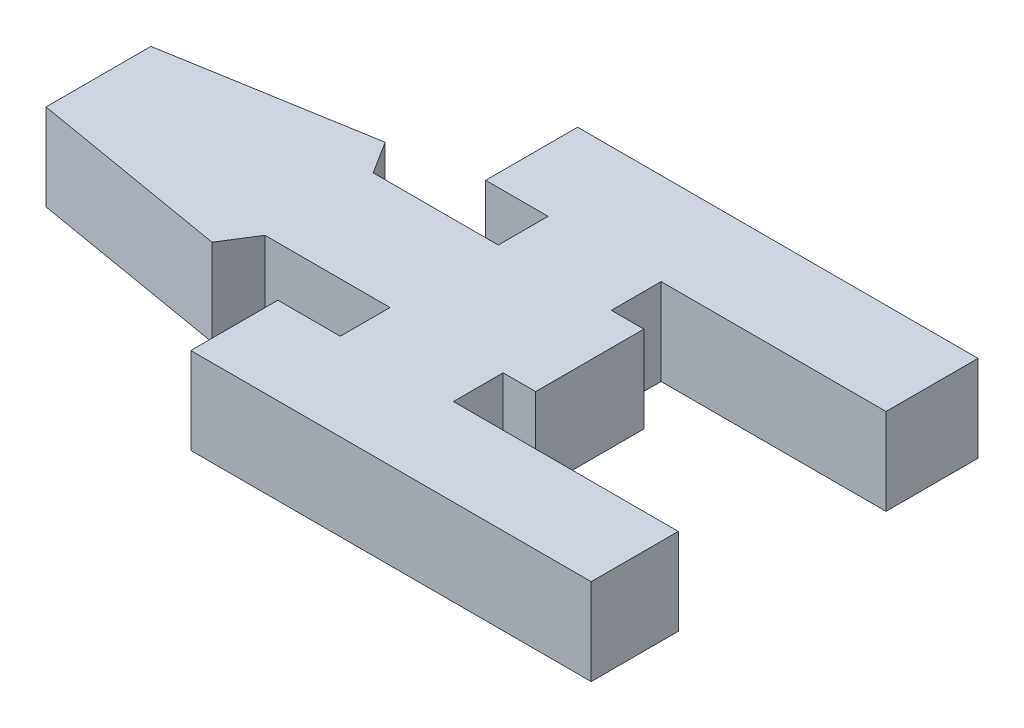
ISO-10303-21;
HEADER;
FILE_DESCRIPTION(('STEP AP214'),'2;1');
FILE_NAME('part.step','',(''),(''),'','','');
FILE_SCHEMA(('AUTOMOTIVE_DESIGN { 1 0 10303 214 1 1 1 1 }'));
ENDSEC;
DATA;
#1=APPLICATION_CONTEXT('core data for automotive mechanical design processes');
#2=APPLICATION_PROTOCOL_DEFINITION('international standard','automotive_design',2000,#1);
#3=PRODUCT_CONTEXT('',#1,'mechanical');
#4=PRODUCT('Part','Part','',(#3));
#5=PRODUCT_RELATED_PRODUCT_CATEGORY('part','',(#4));
#6=PRODUCT_DEFINITION_FORMATION('','',#4);
#7=PRODUCT_DEFINITION_CONTEXT('part definition',#1,'design');
#8=PRODUCT_DEFINITION('design','',#6,#7);
#9=PRODUCT_DEFINITION_SHAPE('','',#8);
#10=(LENGTH_UNIT() NAMED_UNIT(*) SI_UNIT(.MILLI.,.METRE.));
#11=(NAMED_UNIT(*) PLANE_ANGLE_UNIT() SI_UNIT($,.RADIAN.));
#12=(NAMED_UNIT(*) SI_UNIT($,.STERADIAN.) SOLID_ANGLE_UNIT());
#13=UNCERTAINTY_MEASURE_WITH_UNIT(LENGTH_MEASURE(1.E-05),#10,'distance_accuracy_value','');
#14=(GEOMETRIC_REPRESENTATION_CONTEXT(3) GLOBAL_UNCERTAINTY_ASSIGNED_CONTEXT((#13)) GLOBAL_UNIT_ASSIGNED_CONTEXT((#10,
#11,#12)) REPRESENTATION_CONTEXT('',''));
#15=CARTESIAN_POINT('',(0.,0.,0.));
#16=DIRECTION('',(0.,0.,1.));
#17=DIRECTION('',(1.,0.,0.));
#18=AXIS2_PLACEMENT_3D('',#15,#16,#17);
#19=CARTESIAN_POINT('',(37.6764063249221,8.,-46.6193365685928));
#20=DIRECTION('',(0.,0.,1.));
#21=DIRECTION('',(1.,0.,0.));
#22=AXIS2_PLACEMENT_3D('',#19,#20,#21);
#23=PLANE('',#22);
#24=DIRECTION('',(-1.,0.,0.));
#25=VECTOR('',#24,1.);
#26=CARTESIAN_POINT('',(37.6764063249221,0.,-46.6193365685928));
#27=LINE('',#26,#25);
#28=CARTESIAN_POINT('',(49.238802000088,0.,-46.6193365685928));
#29=VERTEX_POINT('',#28);
#30=CARTESIAN_POINT('',(37.6764063249221,0.,-46.6193365685928));
#31=VERTEX_POINT('',#30);
#32=EDGE_CURVE('E225',#29,#31,#27,.T.);
#33=ORIENTED_EDGE('',*,*,#32,.T.);
#34=DIRECTION('',(0.,-1.,0.));
#35=VECTOR('',#34,1.);
#36=CARTESIAN_POINT('',(37.6764063249221,8.,-46.6193365685928));
#37=LINE('',#36,#35);
#38=CARTESIAN_POINT('',(37.6764063249221,8.,-46.6193365685928));
#39=VERTEX_POINT('',#38);
#40=EDGE_CURVE('E11',#39,#31,#37,.T.);
#41=ORIENTED_EDGE('',*,*,#40,.F.);
#42=DIRECTION('',(-1.,0.,0.));
#43=VECTOR('',#42,1.);
#44=CARTESIAN_POINT('',(37.6764063249221,8.,-46.6193365685928));
#45=LINE('',#44,#43);
#46=CARTESIAN_POINT('',(49.238802000088,8.,-46.6193365685928));
#47=VERTEX_POINT('',#46);
#48=EDGE_CURVE('E272',#47,#39,#45,.T.);
#49=ORIENTED_EDGE('',*,*,#48,.F.);
#50=DIRECTION('',(0.,-1.,0.));
#51=VECTOR('',#50,1.);
#52=CARTESIAN_POINT('',(49.238802000088,8.,-46.6193365685928));
#53=LINE('',#52,#51);
#54=EDGE_CURVE('E221',#47,#29,#53,.T.);
#55=ORIENTED_EDGE('',*,*,#54,.T.);
#56=EDGE_LOOP('',(#33,#41,#49,#55));
#57=FACE_BOUND('',#56,.T.);
#58=ADVANCED_FACE('F33',(#57),#23,.F.);
#59=CARTESIAN_POINT('',(35.7855400379757,8.,-49.6193365685928));
#60=DIRECTION('',(-0.845981326623893,0.,0.533212523299743));
#61=DIRECTION('',(0.533212523299743,0.,0.845981326623893));
#62=AXIS2_PLACEMENT_3D('',#59,#60,#61);
#63=PLANE('',#62);
#64=DIRECTION('',(-0.533212523299743,0.,-0.845981326623893));
#65=VECTOR('',#64,1.);
#66=CARTESIAN_POINT('',(35.7855400379757,0.,-49.6193365685928));
#67=LINE('',#66,#65);
#68=CARTESIAN_POINT('',(35.7855400379757,0.,-49.6193365685928));
#69=VERTEX_POINT('',#68);
#70=EDGE_CURVE('E228',#31,#69,#67,.T.);
#71=ORIENTED_EDGE('',*,*,#70,.T.);
#72=DIRECTION('',(0.,-1.,0.));
#73=VECTOR('',#72,1.);
#74=CARTESIAN_POINT('',(35.7855400379757,8.,-49.6193365685928));
#75=LINE('',#74,#73);
#76=CARTESIAN_POINT('',(35.7855400379757,8.,-49.6193365685928));
#77=VERTEX_POINT('',#76);
#78=EDGE_CURVE('E41',#77,#69,#75,.T.);
#79=ORIENTED_EDGE('',*,*,#78,.F.);
#80=DIRECTION('',(-0.533212523299743,0.,-0.845981326623893));
#81=VECTOR('',#80,1.);
#82=CARTESIAN_POINT('',(35.7855400379757,8.,-49.6193365685928));
#83=LINE('',#82,#81);
#84=EDGE_CURVE('E140',#39,#77,#83,.T.);
#85=ORIENTED_EDGE('',*,*,#84,.F.);
#86=ORIENTED_EDGE('',*,*,#40,.T.);
#87=EDGE_LOOP('',(#71,#79,#85,#86));
#88=FACE_BOUND('',#87,.T.);
#89=ADVANCED_FACE('F410',(#88),#63,.F.);
#90=CARTESIAN_POINT('',(17.2873048400714,8.,-46.4669887016048));
#91=DIRECTION('',(0.167991595603927,0.,0.985788427506859));
#92=DIRECTION('',(0.98578842750686,0.,-0.167991595603927));
#93=AXIS2_PLACEMENT_3D('',#90,#91,#92);
#94=PLANE('',#93);
#95=DIRECTION('',(-0.98578842750686,0.,0.167991595603927));
#96=VECTOR('',#95,1.);
#97=CARTESIAN_POINT('',(17.2873048400714,0.,-46.4669887016048));
#98=LINE('',#97,#96);
#99=CARTESIAN_POINT('',(17.2873048400714,0.,-46.4669887016048));
#100=VERTEX_POINT('',#99);
#101=EDGE_CURVE('E231',#69,#100,#98,.T.);
#102=ORIENTED_EDGE('',*,*,#101,.T.);
#103=DIRECTION('',(0.,-1.,0.));
#104=VECTOR('',#103,1.);
#105=CARTESIAN_POINT('',(17.2873048400714,8.,-46.4669887016048));
#106=LINE('',#105,#104);
#107=CARTESIAN_POINT('',(17.2873048400714,8.,-46.4669887016048));
#108=VERTEX_POINT('',#107);
#109=EDGE_CURVE('E327',#108,#100,#106,.T.);
#110=ORIENTED_EDGE('',*,*,#109,.F.);
#111=DIRECTION('',(-0.98578842750686,0.,0.167991595603927));
#112=VECTOR('',#111,1.);
#113=CARTESIAN_POINT('',(17.2873048400714,8.,-46.4669887016048));
#114=LINE('',#113,#112);
#115=EDGE_CURVE('E335',#77,#108,#114,.T.);
#116=ORIENTED_EDGE('',*,*,#115,.F.);
#117=ORIENTED_EDGE('',*,*,#78,.T.);
#118=EDGE_LOOP('',(#102,#110,#116,#117));
#119=FACE_BOUND('',#118,.T.);
#120=ADVANCED_FACE('F333',(#119),#94,.F.);
#121=CARTESIAN_POINT('',(17.2873048400714,8.,-46.4669887016048));
#122=DIRECTION('',(1.,0.,0.));
#123=DIRECTION('',(0.,0.,-1.));
#124=AXIS2_PLACEMENT_3D('',#121,#122,#123);
#125=PLANE('',#124);
#126=DIRECTION('',(0.,0.,1.));
#127=VECTOR('',#126,1.);
#128=CARTESIAN_POINT('',(17.2873048400714,0.,-46.4669887016048));
#129=LINE('',#128,#127);
#130=CARTESIAN_POINT('',(17.2873048400714,0.,-36.7743365685928));
#131=VERTEX_POINT('',#130);
#132=EDGE_CURVE('E233',#100,#131,#129,.T.);
#133=ORIENTED_EDGE('',*,*,#132,.T.);
#134=DIRECTION('',(0.,-1.,0.));
#135=VECTOR('',#134,1.);
#136=CARTESIAN_POINT('',(17.2873048400714,8.,-36.7743365685928));
#137=LINE('',#136,#135);
#138=CARTESIAN_POINT('',(17.2873048400714,8.,-36.7743365685928));
#139=VERTEX_POINT('',#138);
#140=EDGE_CURVE('E324',#139,#131,#137,.T.);
#141=ORIENTED_EDGE('',*,*,#140,.F.);
#142=DIRECTION('',(0.,0.,1.));
#143=VECTOR('',#142,1.);
#144=CARTESIAN_POINT('',(17.2873048400714,8.,-46.4669887016048));
#145=LINE('',#144,#143);
#146=EDGE_CURVE('E353',#108,#139,#145,.T.);
#147=ORIENTED_EDGE('',*,*,#146,.F.);
#148=ORIENTED_EDGE('',*,*,#109,.T.);
#149=EDGE_LOOP('',(#133,#141,#147,#148));
#150=FACE_BOUND('',#149,.T.);
#151=ADVANCED_FACE('F344',(#150),#125,.F.);
#152=CARTESIAN_POINT('',(35.7855400379758,8.,-33.6193365685928));
#153=DIRECTION('',(0.168128936753978,0.,-0.985765012883891));
#154=DIRECTION('',(-0.985765012883891,0.,-0.168128936753978));
#155=AXIS2_PLACEMENT_3D('',#152,#153,#154);
#156=PLANE('',#155);
#157=DIRECTION('',(0.985765012883891,0.,0.168128936753978));
#158=VECTOR('',#157,1.);
#159=CARTESIAN_POINT('',(35.7855400379758,0.,-33.6193365685928));
#160=LINE('',#159,#158);
#161=CARTESIAN_POINT('',(35.7855400379758,0.,-33.6193365685928));
#162=VERTEX_POINT('',#161);
#163=EDGE_CURVE('E235',#131,#162,#160,.T.);
#164=ORIENTED_EDGE('',*,*,#163,.T.);
#165=DIRECTION('',(0.,-1.,0.));
#166=VECTOR('',#165,1.);
#167=CARTESIAN_POINT('',(35.7855400379758,8.,-33.6193365685928));
#168=LINE('',#167,#166);
#169=CARTESIAN_POINT('',(35.7855400379758,8.,-33.6193365685928));
#170=VERTEX_POINT('',#169);
#171=EDGE_CURVE('E321',#170,#162,#168,.T.);
#172=ORIENTED_EDGE('',*,*,#171,.F.);
#173=DIRECTION('',(0.985765012883891,0.,0.168128936753978));
#174=VECTOR('',#173,1.);
#175=CARTESIAN_POINT('',(35.7855400379758,8.,-33.6193365685928));
#176=LINE('',#175,#174);
#177=EDGE_CURVE('E350',#139,#170,#176,.T.);
#178=ORIENTED_EDGE('',*,*,#177,.F.);
#179=ORIENTED_EDGE('',*,*,#140,.T.);
#180=EDGE_LOOP('',(#164,#172,#178,#179));
#181=FACE_BOUND('',#180,.T.);
#182=ADVANCED_FACE('F348',(#181),#156,.F.);
#183=CARTESIAN_POINT('',(37.6764063249221,8.,-36.6193365685928));
#184=DIRECTION('',(-0.845981326623894,0.,-0.53321252329974));
#185=DIRECTION('',(-0.53321252329974,0.,0.845981326623894));
#186=AXIS2_PLACEMENT_3D('',#183,#184,#185);
#187=PLANE('',#186);
#188=DIRECTION('',(0.53321252329974,0.,-0.845981326623894));
#189=VECTOR('',#188,1.);
#190=CARTESIAN_POINT('',(37.6764063249221,0.,-36.6193365685928));
#191=LINE('',#190,#189);
#192=CARTESIAN_POINT('',(37.6764063249221,0.,-36.6193365685928));
#193=VERTEX_POINT('',#192);
#194=EDGE_CURVE('E237',#162,#193,#191,.T.);
#195=ORIENTED_EDGE('',*,*,#194,.T.);
#196=DIRECTION('',(0.,-1.,0.));
#197=VECTOR('',#196,1.);
#198=CARTESIAN_POINT('',(37.6764063249221,8.,-36.6193365685928));
#199=LINE('',#198,#197);
#200=CARTESIAN_POINT('',(37.6764063249221,8.,-36.6193365685928));
#201=VERTEX_POINT('',#200);
#202=EDGE_CURVE('E318',#201,#193,#199,.T.);
#203=ORIENTED_EDGE('',*,*,#202,.F.);
#204=DIRECTION('',(0.53321252329974,0.,-0.845981326623894));
#205=VECTOR('',#204,1.);
#206=CARTESIAN_POINT('',(37.6764063249221,8.,-36.6193365685928));
#207=LINE('',#206,#205);
#208=EDGE_CURVE('E352',#170,#201,#207,.T.);
#209=ORIENTED_EDGE('',*,*,#208,.F.);
#210=ORIENTED_EDGE('',*,*,#171,.T.);
#211=EDGE_LOOP('',(#195,#203,#209,#210));
#212=FACE_BOUND('',#211,.T.);
#213=ADVANCED_FACE('F423',(#212),#187,.F.);
#214=CARTESIAN_POINT('',(37.6764063249221,8.,-36.6193365685928));
#215=DIRECTION('',(0.,0.,-1.));
#216=DIRECTION('',(-1.,0.,0.));
#217=AXIS2_PLACEMENT_3D('',#214,#215,#216);
#218=PLANE('',#217);
#219=DIRECTION('',(1.,0.,0.));
#220=VECTOR('',#219,1.);
#221=CARTESIAN_POINT('',(37.6764063249221,0.,-36.6193365685928));
#222=LINE('',#221,#220);
#223=CARTESIAN_POINT('',(49.238802000088,0.,-36.6193365685928));
#224=VERTEX_POINT('',#223);
#225=EDGE_CURVE('E239',#193,#224,#222,.T.);
#226=ORIENTED_EDGE('',*,*,#225,.T.);
#227=DIRECTION('',(0.,-1.,0.));
#228=VECTOR('',#227,1.);
#229=CARTESIAN_POINT('',(49.238802000088,8.,-36.6193365685928));
#230=LINE('',#229,#228);
#231=CARTESIAN_POINT('',(49.238802000088,8.,-36.6193365685928));
#232=VERTEX_POINT('',#231);
#233=EDGE_CURVE('E315',#232,#224,#230,.T.);
#234=ORIENTED_EDGE('',*,*,#233,.F.);
#235=DIRECTION('',(1.,0.,0.));
#236=VECTOR('',#235,1.);
#237=CARTESIAN_POINT('',(37.6764063249221,8.,-36.6193365685928));
#238=LINE('',#237,#236);
#239=EDGE_CURVE('E355',#201,#232,#238,.T.);
#240=ORIENTED_EDGE('',*,*,#239,.F.);
#241=ORIENTED_EDGE('',*,*,#202,.T.);
#242=EDGE_LOOP('',(#226,#234,#240,#241));
#243=FACE_BOUND('',#242,.T.);
#244=ADVANCED_FACE('F426',(#243),#218,.F.);
#245=CARTESIAN_POINT('',(49.238802000088,8.,-36.6193365685928));
#246=DIRECTION('',(1.,0.,0.));
#247=DIRECTION('',(0.,0.,-1.));
#248=AXIS2_PLACEMENT_3D('',#245,#246,#247);
#249=PLANE('',#248);
#250=DIRECTION('',(0.,0.,1.));
#251=VECTOR('',#250,1.);
#252=CARTESIAN_POINT('',(49.238802000088,0.,-36.6193365685928));
#253=LINE('',#252,#251);
#254=CARTESIAN_POINT('',(49.238802000088,0.,-32.0193365685928));
#255=VERTEX_POINT('',#254);
#256=EDGE_CURVE('E241',#224,#255,#253,.T.);
#257=ORIENTED_EDGE('',*,*,#256,.T.);
#258=DIRECTION('',(0.,-1.,0.));
#259=VECTOR('',#258,1.);
#260=CARTESIAN_POINT('',(49.238802000088,8.,-32.0193365685928));
#261=LINE('',#260,#259);
#262=CARTESIAN_POINT('',(49.238802000088,8.,-32.0193365685928));
#263=VERTEX_POINT('',#262);
#264=EDGE_CURVE('E312',#263,#255,#261,.T.);
#265=ORIENTED_EDGE('',*,*,#264,.F.);
#266=DIRECTION('',(0.,0.,1.));
#267=VECTOR('',#266,1.);
#268=CARTESIAN_POINT('',(49.238802000088,8.,-36.6193365685928));
#269=LINE('',#268,#267);
#270=EDGE_CURVE('E361',#232,#263,#269,.T.);
#271=ORIENTED_EDGE('',*,*,#270,.F.);
#272=ORIENTED_EDGE('',*,*,#233,.T.);
#273=EDGE_LOOP('',(#257,#265,#271,#272));
#274=FACE_BOUND('',#273,.T.);
#275=ADVANCED_FACE('F430',(#274),#249,.F.);
#276=CARTESIAN_POINT('',(49.238802000088,8.,-32.0193365685928));
#277=DIRECTION('',(0.,0.,1.));
#278=DIRECTION('',(1.,0.,0.));
#279=AXIS2_PLACEMENT_3D('',#276,#277,#278);
#280=PLANE('',#279);
#281=DIRECTION('',(-1.,0.,0.));
#282=VECTOR('',#281,1.);
#283=CARTESIAN_POINT('',(49.238802000088,0.,-32.0193365685928));
#284=LINE('',#283,#282);
#285=CARTESIAN_POINT('',(43.4731183020399,0.,-32.0193365685928));
#286=VERTEX_POINT('',#285);
#287=EDGE_CURVE('E243',#255,#286,#284,.T.);
#288=ORIENTED_EDGE('',*,*,#287,.T.);
#289=DIRECTION('',(0.,-1.,0.));
#290=VECTOR('',#289,1.);
#291=CARTESIAN_POINT('',(43.4731183020399,8.,-32.0193365685928));
#292=LINE('',#291,#290);
#293=CARTESIAN_POINT('',(43.4731183020399,8.,-32.0193365685928));
#294=VERTEX_POINT('',#293);
#295=EDGE_CURVE('E309',#294,#286,#292,.T.);
#296=ORIENTED_EDGE('',*,*,#295,.F.);
#297=DIRECTION('',(-1.,0.,0.));
#298=VECTOR('',#297,1.);
#299=CARTESIAN_POINT('',(49.238802000088,8.,-32.0193365685928));
#300=LINE('',#299,#298);
#301=EDGE_CURVE('E363',#263,#294,#300,.T.);
#302=ORIENTED_EDGE('',*,*,#301,.F.);
#303=ORIENTED_EDGE('',*,*,#264,.T.);
#304=EDGE_LOOP('',(#288,#296,#302,#303));
#305=FACE_BOUND('',#304,.T.);
#306=ADVANCED_FACE('F434',(#305),#280,.F.);
#307=CARTESIAN_POINT('',(43.4731183020399,8.,-32.0193365685928));
#308=DIRECTION('',(1.,0.,0.));
#309=DIRECTION('',(0.,0.,-1.));
#310=AXIS2_PLACEMENT_3D('',#307,#308,#309);
#311=PLANE('',#310);
#312=DIRECTION('',(0.,0.,1.));
#313=VECTOR('',#312,1.);
#314=CARTESIAN_POINT('',(43.4731183020399,0.,-32.0193365685928));
#315=LINE('',#314,#313);
#316=CARTESIAN_POINT('',(43.4731183020399,0.,-23.9714030734007));
#317=VERTEX_POINT('',#316);
#318=EDGE_CURVE('E245',#286,#317,#315,.T.);
#319=ORIENTED_EDGE('',*,*,#318,.T.);
#320=DIRECTION('',(0.,-1.,0.));
#321=VECTOR('',#320,1.);
#322=CARTESIAN_POINT('',(43.4731183020399,8.,-23.9714030734007));
#323=LINE('',#322,#321);
#324=CARTESIAN_POINT('',(43.4731183020399,8.,-23.9714030734007));
#325=VERTEX_POINT('',#324);
#326=EDGE_CURVE('E306',#325,#317,#323,.T.);
#327=ORIENTED_EDGE('',*,*,#326,.F.);
#328=DIRECTION('',(0.,0.,1.));
#329=VECTOR('',#328,1.);
#330=CARTESIAN_POINT('',(43.4731183020399,8.,-32.0193365685928));
#331=LINE('',#330,#329);
#332=EDGE_CURVE('E365',#294,#325,#331,.T.);
#333=ORIENTED_EDGE('',*,*,#332,.F.);
#334=ORIENTED_EDGE('',*,*,#295,.T.);
#335=EDGE_LOOP('',(#319,#327,#333,#334));
#336=FACE_BOUND('',#335,.T.);
#337=ADVANCED_FACE('F438',(#336),#311,.F.);
#338=CARTESIAN_POINT('',(80.4731183020399,8.,-23.9714030734007));
#339=DIRECTION('',(0.,0.,-1.));
#340=DIRECTION('',(-1.,0.,0.));
#341=AXIS2_PLACEMENT_3D('',#338,#339,#340);
#342=PLANE('',#341);
#343=DIRECTION('',(1.,0.,0.));
#344=VECTOR('',#343,1.);
#345=CARTESIAN_POINT('',(80.4731183020399,0.,-23.9714030734007));
#346=LINE('',#345,#344);
#347=CARTESIAN_POINT('',(80.4731183020399,0.,-23.9714030734007));
#348=VERTEX_POINT('',#347);
#349=EDGE_CURVE('E247',#317,#348,#346,.T.);
#350=ORIENTED_EDGE('',*,*,#349,.T.);
#351=DIRECTION('',(0.,-1.,0.));
#352=VECTOR('',#351,1.);
#353=CARTESIAN_POINT('',(80.4731183020399,8.,-23.9714030734007));
#354=LINE('',#353,#352);
#355=CARTESIAN_POINT('',(80.4731183020399,8.,-23.9714030734007));
#356=VERTEX_POINT('',#355);
#357=EDGE_CURVE('E303',#356,#348,#354,.T.);
#358=ORIENTED_EDGE('',*,*,#357,.F.);
#359=DIRECTION('',(1.,0.,0.));
#360=VECTOR('',#359,1.);
#361=CARTESIAN_POINT('',(80.4731183020399,8.,-23.9714030734007));
#362=LINE('',#361,#360);
#363=EDGE_CURVE('E367',#325,#356,#362,.T.);
#364=ORIENTED_EDGE('',*,*,#363,.F.);
#365=ORIENTED_EDGE('',*,*,#326,.T.);
#366=EDGE_LOOP('',(#350,#358,#364,#365));
#367=FACE_BOUND('',#366,.T.);
#368=ADVANCED_FACE('F442',(#367),#342,.F.);
#369=CARTESIAN_POINT('',(80.4731183020399,8.,-32.0193365685928));
#370=DIRECTION('',(-1.,0.,0.));
#371=DIRECTION('',(0.,0.,1.));
#372=AXIS2_PLACEMENT_3D('',#369,#370,#371);
#373=PLANE('',#372);
#374=DIRECTION('',(0.,0.,-1.));
#375=VECTOR('',#374,1.);
#376=CARTESIAN_POINT('',(80.4731183020399,0.,-32.0193365685928));
#377=LINE('',#376,#375);
#378=CARTESIAN_POINT('',(80.4731183020399,0.,-32.0193365685928));
#379=VERTEX_POINT('',#378);
#380=EDGE_CURVE('E249',#348,#379,#377,.T.);
#381=ORIENTED_EDGE('',*,*,#380,.T.);
#382=DIRECTION('',(0.,-1.,0.));
#383=VECTOR('',#382,1.);
#384=CARTESIAN_POINT('',(80.4731183020399,8.,-32.0193365685928));
#385=LINE('',#384,#383);
#386=CARTESIAN_POINT('',(80.4731183020399,8.,-32.0193365685928));
#387=VERTEX_POINT('',#386);
#388=EDGE_CURVE('E300',#387,#379,#385,.T.);
#389=ORIENTED_EDGE('',*,*,#388,.F.);
#390=DIRECTION('',(0.,0.,-1.));
#391=VECTOR('',#390,1.);
#392=CARTESIAN_POINT('',(80.4731183020399,8.,-32.0193365685928));
#393=LINE('',#392,#391);
#394=EDGE_CURVE('E369',#356,#387,#393,.T.);
#395=ORIENTED_EDGE('',*,*,#394,.F.);
#396=ORIENTED_EDGE('',*,*,#357,.T.);
#397=EDGE_LOOP('',(#381,#389,#395,#396));
#398=FACE_BOUND('',#397,.T.);
#399=ADVANCED_FACE('F446',(#398),#373,.F.);
#400=CARTESIAN_POINT('',(80.4731183020399,8.,-32.0193365685928));
#401=DIRECTION('',(0.,0.,1.));
#402=DIRECTION('',(1.,0.,0.));
#403=AXIS2_PLACEMENT_3D('',#400,#401,#402);
#404=PLANE('',#403);
#405=DIRECTION('',(-1.,0.,0.));
#406=VECTOR('',#405,1.);
#407=CARTESIAN_POINT('',(80.4731183020399,0.,-32.0193365685928));
#408=LINE('',#407,#406);
#409=CARTESIAN_POINT('',(59.6891037028002,0.,-32.0193365685928));
#410=VERTEX_POINT('',#409);
#411=EDGE_CURVE('E251',#379,#410,#408,.T.);
#412=ORIENTED_EDGE('',*,*,#411,.T.);
#413=DIRECTION('',(0.,-1.,0.));
#414=VECTOR('',#413,1.);
#415=CARTESIAN_POINT('',(59.6891037028002,8.,-32.0193365685928));
#416=LINE('',#415,#414);
#417=CARTESIAN_POINT('',(59.6891037028002,8.,-32.0193365685928));
#418=VERTEX_POINT('',#417);
#419=EDGE_CURVE('E297',#418,#410,#416,.T.);
#420=ORIENTED_EDGE('',*,*,#419,.F.);
#421=DIRECTION('',(-1.,0.,0.));
#422=VECTOR('',#421,1.);
#423=CARTESIAN_POINT('',(80.4731183020399,8.,-32.0193365685928));
#424=LINE('',#423,#422);
#425=EDGE_CURVE('E371',#387,#418,#424,.T.);
#426=ORIENTED_EDGE('',*,*,#425,.F.);
#427=ORIENTED_EDGE('',*,*,#388,.T.);
#428=EDGE_LOOP('',(#412,#420,#426,#427));
#429=FACE_BOUND('',#428,.T.);
#430=ADVANCED_FACE('F450',(#429),#404,.F.);
#431=CARTESIAN_POINT('',(59.6891037028002,8.,-36.6193365685928));
#432=DIRECTION('',(-1.,0.,0.));
#433=DIRECTION('',(0.,0.,1.));
#434=AXIS2_PLACEMENT_3D('',#431,#432,#433);
#435=PLANE('',#434);
#436=DIRECTION('',(0.,0.,-1.));
#437=VECTOR('',#436,1.);
#438=CARTESIAN_POINT('',(59.6891037028002,0.,-36.6193365685928));
#439=LINE('',#438,#437);
#440=CARTESIAN_POINT('',(59.6891037028002,0.,-36.6193365685928));
#441=VERTEX_POINT('',#440);
#442=EDGE_CURVE('E253',#410,#441,#439,.T.);
#443=ORIENTED_EDGE('',*,*,#442,.T.);
#444=DIRECTION('',(0.,-1.,0.));
#445=VECTOR('',#444,1.);
#446=CARTESIAN_POINT('',(59.6891037028002,8.,-36.6193365685928));
#447=LINE('',#446,#445);
#448=CARTESIAN_POINT('',(59.6891037028002,8.,-36.6193365685928));
#449=VERTEX_POINT('',#448);
#450=EDGE_CURVE('E294',#449,#441,#447,.T.);
#451=ORIENTED_EDGE('',*,*,#450,.F.);
#452=DIRECTION('',(0.,0.,-1.));
#453=VECTOR('',#452,1.);
#454=CARTESIAN_POINT('',(59.6891037028002,8.,-36.6193365685928));
#455=LINE('',#454,#453);
#456=EDGE_CURVE('E373',#418,#449,#455,.T.);
#457=ORIENTED_EDGE('',*,*,#456,.F.);
#458=ORIENTED_EDGE('',*,*,#419,.T.);
#459=EDGE_LOOP('',(#443,#451,#457,#458));
#460=FACE_BOUND('',#459,.T.);
#461=ADVANCED_FACE('F454',(#460),#435,.F.);
#462=CARTESIAN_POINT('',(59.6891037028002,8.,-36.6193365685928));
#463=DIRECTION('',(0.,0.,-1.));
#464=DIRECTION('',(-1.,0.,0.));
#465=AXIS2_PLACEMENT_3D('',#462,#463,#464);
#466=PLANE('',#465);
#467=DIRECTION('',(1.,0.,0.));
#468=VECTOR('',#467,1.);
#469=CARTESIAN_POINT('',(59.6891037028002,0.,-36.6193365685928));
#470=LINE('',#469,#468);
#471=CARTESIAN_POINT('',(62.6920639622002,0.,-36.6193365685928));
#472=VERTEX_POINT('',#471);
#473=EDGE_CURVE('E255',#441,#472,#470,.T.);
#474=ORIENTED_EDGE('',*,*,#473,.T.);
#475=DIRECTION('',(0.,-1.,0.));
#476=VECTOR('',#475,1.);
#477=CARTESIAN_POINT('',(62.6920639622002,8.,-36.6193365685928));
#478=LINE('',#477,#476);
#479=CARTESIAN_POINT('',(62.6920639622002,8.,-36.6193365685928));
#480=VERTEX_POINT('',#479);
#481=EDGE_CURVE('E291',#480,#472,#478,.T.);
#482=ORIENTED_EDGE('',*,*,#481,.F.);
#483=DIRECTION('',(1.,0.,0.));
#484=VECTOR('',#483,1.);
#485=CARTESIAN_POINT('',(59.6891037028002,8.,-36.6193365685928));
#486=LINE('',#485,#484);
#487=EDGE_CURVE('E375',#449,#480,#486,.T.);
#488=ORIENTED_EDGE('',*,*,#487,.F.);
#489=ORIENTED_EDGE('',*,*,#450,.T.);
#490=EDGE_LOOP('',(#474,#482,#488,#489));
#491=FACE_BOUND('',#490,.T.);
#492=ADVANCED_FACE('F458',(#491),#466,.F.);
#493=CARTESIAN_POINT('',(62.6920639622002,8.,-46.6193365685928));
#494=DIRECTION('',(-1.,0.,0.));
#495=DIRECTION('',(0.,0.,1.));
#496=AXIS2_PLACEMENT_3D('',#493,#494,#495);
#497=PLANE('',#496);
#498=DIRECTION('',(0.,0.,-1.));
#499=VECTOR('',#498,1.);
#500=CARTESIAN_POINT('',(62.6920639622002,0.,-46.6193365685928));
#501=LINE('',#500,#499);
#502=CARTESIAN_POINT('',(62.6920639622002,0.,-46.6193365685928));
#503=VERTEX_POINT('',#502);
#504=EDGE_CURVE('E257',#472,#503,#501,.T.);
#505=ORIENTED_EDGE('',*,*,#504,.T.);
#506=DIRECTION('',(0.,-1.,0.));
#507=VECTOR('',#506,1.);
#508=CARTESIAN_POINT('',(62.6920639622002,8.,-46.6193365685928));
#509=LINE('',#508,#507);
#510=CARTESIAN_POINT('',(62.6920639622002,8.,-46.6193365685928));
#511=VERTEX_POINT('',#510);
#512=EDGE_CURVE('E288',#511,#503,#509,.T.);
#513=ORIENTED_EDGE('',*,*,#512,.F.);
#514=DIRECTION('',(0.,0.,-1.));
#515=VECTOR('',#514,1.);
#516=CARTESIAN_POINT('',(62.6920639622002,8.,-46.6193365685928));
#517=LINE('',#516,#515);
#518=EDGE_CURVE('E377',#480,#511,#517,.T.);
#519=ORIENTED_EDGE('',*,*,#518,.F.);
#520=ORIENTED_EDGE('',*,*,#481,.T.);
#521=EDGE_LOOP('',(#505,#513,#519,#520));
#522=FACE_BOUND('',#521,.T.);
#523=ADVANCED_FACE('F462',(#522),#497,.F.);
#524=CARTESIAN_POINT('',(59.6891037028002,8.,-46.6193365685928));
#525=DIRECTION('',(0.,0.,1.));
#526=DIRECTION('',(1.,0.,0.));
#527=AXIS2_PLACEMENT_3D('',#524,#525,#526);
#528=PLANE('',#527);
#529=DIRECTION('',(-1.,0.,0.));
#530=VECTOR('',#529,1.);
#531=CARTESIAN_POINT('',(59.6891037028002,0.,-46.6193365685928));
#532=LINE('',#531,#530);
#533=CARTESIAN_POINT('',(59.6891037028002,0.,-46.6193365685928));
#534=VERTEX_POINT('',#533);
#535=EDGE_CURVE('E259',#503,#534,#532,.T.);
#536=ORIENTED_EDGE('',*,*,#535,.T.);
#537=DIRECTION('',(0.,-1.,0.));
#538=VECTOR('',#537,1.);
#539=CARTESIAN_POINT('',(59.6891037028002,8.,-46.6193365685928));
#540=LINE('',#539,#538);
#541=CARTESIAN_POINT('',(59.6891037028002,8.,-46.6193365685928));
#542=VERTEX_POINT('',#541);
#543=EDGE_CURVE('E285',#542,#534,#540,.T.);
#544=ORIENTED_EDGE('',*,*,#543,.F.);
#545=DIRECTION('',(-1.,0.,0.));
#546=VECTOR('',#545,1.);
#547=CARTESIAN_POINT('',(59.6891037028002,8.,-46.6193365685928));
#548=LINE('',#547,#546);
#549=EDGE_CURVE('E379',#511,#542,#548,.T.);
#550=ORIENTED_EDGE('',*,*,#549,.F.);
#551=ORIENTED_EDGE('',*,*,#512,.T.);
#552=EDGE_LOOP('',(#536,#544,#550,#551));
#553=FACE_BOUND('',#552,.T.);
#554=ADVANCED_FACE('F466',(#553),#528,.F.);
#555=CARTESIAN_POINT('',(59.6891037028002,8.,-51.2193365685928));
#556=DIRECTION('',(-1.,0.,0.));
#557=DIRECTION('',(0.,0.,1.));
#558=AXIS2_PLACEMENT_3D('',#555,#556,#557);
#559=PLANE('',#558);
#560=DIRECTION('',(0.,0.,-1.));
#561=VECTOR('',#560,1.);
#562=CARTESIAN_POINT('',(59.6891037028002,0.,-51.2193365685928));
#563=LINE('',#562,#561);
#564=CARTESIAN_POINT('',(59.6891037028002,0.,-51.2193365685928));
#565=VERTEX_POINT('',#564);
#566=EDGE_CURVE('E261',#534,#565,#563,.T.);
#567=ORIENTED_EDGE('',*,*,#566,.T.);
#568=DIRECTION('',(0.,-1.,0.));
#569=VECTOR('',#568,1.);
#570=CARTESIAN_POINT('',(59.6891037028002,8.,-51.2193365685928));
#571=LINE('',#570,#569);
#572=CARTESIAN_POINT('',(59.6891037028002,8.,-51.2193365685928));
#573=VERTEX_POINT('',#572);
#574=EDGE_CURVE('E282',#573,#565,#571,.T.);
#575=ORIENTED_EDGE('',*,*,#574,.F.);
#576=DIRECTION('',(0.,0.,-1.));
#577=VECTOR('',#576,1.);
#578=CARTESIAN_POINT('',(59.6891037028002,8.,-51.2193365685928));
#579=LINE('',#578,#577);
#580=EDGE_CURVE('E381',#542,#573,#579,.T.);
#581=ORIENTED_EDGE('',*,*,#580,.F.);
#582=ORIENTED_EDGE('',*,*,#543,.T.);
#583=EDGE_LOOP('',(#567,#575,#581,#582));
#584=FACE_BOUND('',#583,.T.);
#585=ADVANCED_FACE('F470',(#584),#559,.F.);
#586=CARTESIAN_POINT('',(59.6891037028002,8.,-51.2193365685928));
#587=DIRECTION('',(0.,0.,-1.));
#588=DIRECTION('',(-1.,0.,0.));
#589=AXIS2_PLACEMENT_3D('',#586,#587,#588);
#590=PLANE('',#589);
#591=DIRECTION('',(1.,0.,0.));
#592=VECTOR('',#591,1.);
#593=CARTESIAN_POINT('',(59.6891037028002,0.,-51.2193365685928));
#594=LINE('',#593,#592);
#595=CARTESIAN_POINT('',(80.4731183020399,0.,-51.2193365685928));
#596=VERTEX_POINT('',#595);
#597=EDGE_CURVE('E263',#565,#596,#594,.T.);
#598=ORIENTED_EDGE('',*,*,#597,.T.);
#599=DIRECTION('',(0.,-1.,0.));
#600=VECTOR('',#599,1.);
#601=CARTESIAN_POINT('',(80.4731183020399,8.,-51.2193365685928));
#602=LINE('',#601,#600);
#603=CARTESIAN_POINT('',(80.4731183020399,8.,-51.2193365685928));
#604=VERTEX_POINT('',#603);
#605=EDGE_CURVE('E279',#604,#596,#602,.T.);
#606=ORIENTED_EDGE('',*,*,#605,.F.);
#607=DIRECTION('',(1.,0.,0.));
#608=VECTOR('',#607,1.);
#609=CARTESIAN_POINT('',(59.6891037028002,8.,-51.2193365685928));
#610=LINE('',#609,#608);
#611=EDGE_CURVE('E383',#573,#604,#610,.T.);
#612=ORIENTED_EDGE('',*,*,#611,.F.);
#613=ORIENTED_EDGE('',*,*,#574,.T.);
#614=EDGE_LOOP('',(#598,#606,#612,#613));
#615=FACE_BOUND('',#614,.T.);
#616=ADVANCED_FACE('F474',(#615),#590,.F.);
#617=CARTESIAN_POINT('',(80.4731183020399,8.,-59.7193365685928));
#618=DIRECTION('',(-1.,0.,0.));
#619=DIRECTION('',(0.,0.,1.));
#620=AXIS2_PLACEMENT_3D('',#617,#618,#619);
#621=PLANE('',#620);
#622=DIRECTION('',(0.,0.,-1.));
#623=VECTOR('',#622,1.);
#624=CARTESIAN_POINT('',(80.4731183020399,0.,-59.7193365685928));
#625=LINE('',#624,#623);
#626=CARTESIAN_POINT('',(80.4731183020399,0.,-59.7193365685928));
#627=VERTEX_POINT('',#626);
#628=EDGE_CURVE('E265',#596,#627,#625,.T.);
#629=ORIENTED_EDGE('',*,*,#628,.T.);
#630=DIRECTION('',(0.,-1.,0.));
#631=VECTOR('',#630,1.);
#632=CARTESIAN_POINT('',(80.4731183020399,8.,-59.7193365685928));
#633=LINE('',#632,#631);
#634=CARTESIAN_POINT('',(80.4731183020399,8.,-59.7193365685928));
#635=VERTEX_POINT('',#634);
#636=EDGE_CURVE('E276',#635,#627,#633,.T.);
#637=ORIENTED_EDGE('',*,*,#636,.F.);
#638=DIRECTION('',(0.,0.,-1.));
#639=VECTOR('',#638,1.);
#640=CARTESIAN_POINT('',(80.4731183020399,8.,-59.7193365685928));
#641=LINE('',#640,#639);
#642=EDGE_CURVE('E385',#604,#635,#641,.T.);
#643=ORIENTED_EDGE('',*,*,#642,.F.);
#644=ORIENTED_EDGE('',*,*,#605,.T.);
#645=EDGE_LOOP('',(#629,#637,#643,#644));
#646=FACE_BOUND('',#645,.T.);
#647=ADVANCED_FACE('F391',(#646),#621,.F.);
#648=CARTESIAN_POINT('',(43.4731183020399,8.,-59.7193365685928));
#649=DIRECTION('',(0.,0.,1.));
#650=DIRECTION('',(1.,0.,0.));
#651=AXIS2_PLACEMENT_3D('',#648,#649,#650);
#652=PLANE('',#651);
#653=DIRECTION('',(-1.,0.,0.));
#654=VECTOR('',#653,1.);
#655=CARTESIAN_POINT('',(43.4731183020399,0.,-59.7193365685928));
#656=LINE('',#655,#654);
#657=CARTESIAN_POINT('',(43.4731183020399,0.,-59.7193365685928));
#658=VERTEX_POINT('',#657);
#659=EDGE_CURVE('E267',#627,#658,#656,.T.);
#660=ORIENTED_EDGE('',*,*,#659,.T.);
#661=DIRECTION('',(0.,-1.,0.));
#662=VECTOR('',#661,1.);
#663=CARTESIAN_POINT('',(43.4731183020399,8.,-59.7193365685928));
#664=LINE('',#663,#662);
#665=CARTESIAN_POINT('',(43.4731183020399,8.,-59.7193365685928));
#666=VERTEX_POINT('',#665);
#667=EDGE_CURVE('E216',#666,#658,#664,.T.);
#668=ORIENTED_EDGE('',*,*,#667,.F.);
#669=DIRECTION('',(-1.,0.,0.));
#670=VECTOR('',#669,1.);
#671=CARTESIAN_POINT('',(43.4731183020399,8.,-59.7193365685928));
#672=LINE('',#671,#670);
#673=EDGE_CURVE('E207',#635,#666,#672,.T.);
#674=ORIENTED_EDGE('',*,*,#673,.F.);
#675=ORIENTED_EDGE('',*,*,#636,.T.);
#676=EDGE_LOOP('',(#660,#668,#674,#675));
#677=FACE_BOUND('',#676,.T.);
#678=ADVANCED_FACE('F395',(#677),#652,.F.);
#679=CARTESIAN_POINT('',(43.4731183020399,8.,-59.7193365685928));
#680=DIRECTION('',(1.,0.,0.));
#681=DIRECTION('',(0.,0.,-1.));
#682=AXIS2_PLACEMENT_3D('',#679,#680,#681);
#683=PLANE('',#682);
#684=DIRECTION('',(0.,0.,1.));
#685=VECTOR('',#684,1.);
#686=CARTESIAN_POINT('',(43.4731183020399,0.,-59.7193365685928));
#687=LINE('',#686,#685);
#688=CARTESIAN_POINT('',(43.4731183020399,0.,-51.2193365685928));
#689=VERTEX_POINT('',#688);
#690=EDGE_CURVE('E215',#658,#689,#687,.T.);
#691=ORIENTED_EDGE('',*,*,#690,.T.);
#692=DIRECTION('',(0.,-1.,0.));
#693=VECTOR('',#692,1.);
#694=CARTESIAN_POINT('',(43.4731183020399,8.,-51.2193365685928));
#695=LINE('',#694,#693);
#696=CARTESIAN_POINT('',(43.4731183020399,8.,-51.2193365685928));
#697=VERTEX_POINT('',#696);
#698=EDGE_CURVE('E212',#697,#689,#695,.T.);
#699=ORIENTED_EDGE('',*,*,#698,.F.);
#700=DIRECTION('',(0.,0.,1.));
#701=VECTOR('',#700,1.);
#702=CARTESIAN_POINT('',(43.4731183020399,8.,-59.7193365685928));
#703=LINE('',#702,#701);
#704=EDGE_CURVE('E201',#666,#697,#703,.T.);
#705=ORIENTED_EDGE('',*,*,#704,.F.);
#706=ORIENTED_EDGE('',*,*,#667,.T.);
#707=EDGE_LOOP('',(#691,#699,#705,#706));
#708=FACE_BOUND('',#707,.T.);
#709=ADVANCED_FACE('F213',(#708),#683,.F.);
#710=CARTESIAN_POINT('',(43.4731183020399,8.,-51.2193365685928));
#711=DIRECTION('',(0.,0.,-1.));
#712=DIRECTION('',(-1.,0.,0.));
#713=AXIS2_PLACEMENT_3D('',#710,#711,#712);
#714=PLANE('',#713);
#715=DIRECTION('',(1.,0.,0.));
#716=VECTOR('',#715,1.);
#717=CARTESIAN_POINT('',(43.4731183020399,0.,-51.2193365685928));
#718=LINE('',#717,#716);
#719=CARTESIAN_POINT('',(49.238802000088,0.,-51.2193365685928));
#720=VERTEX_POINT('',#719);
#721=EDGE_CURVE('E126',#689,#720,#718,.T.);
#722=ORIENTED_EDGE('',*,*,#721,.T.);
#723=DIRECTION('',(0.,-1.,0.));
#724=VECTOR('',#723,1.);
#725=CARTESIAN_POINT('',(49.238802000088,8.,-51.2193365685928));
#726=LINE('',#725,#724);
#727=CARTESIAN_POINT('',(49.238802000088,8.,-51.2193365685928));
#728=VERTEX_POINT('',#727);
#729=EDGE_CURVE('E217',#728,#720,#726,.T.);
#730=ORIENTED_EDGE('',*,*,#729,.F.);
#731=DIRECTION('',(1.,0.,0.));
#732=VECTOR('',#731,1.);
#733=CARTESIAN_POINT('',(43.4731183020399,8.,-51.2193365685928));
#734=LINE('',#733,#732);
#735=EDGE_CURVE('E205',#697,#728,#734,.T.);
#736=ORIENTED_EDGE('',*,*,#735,.F.);
#737=ORIENTED_EDGE('',*,*,#698,.T.);
#738=EDGE_LOOP('',(#722,#730,#736,#737));
#739=FACE_BOUND('',#738,.T.);
#740=ADVANCED_FACE('F219',(#739),#714,.F.);
#741=CARTESIAN_POINT('',(49.238802000088,8.,-51.2193365685928));
#742=DIRECTION('',(1.,0.,0.));
#743=DIRECTION('',(0.,0.,-1.));
#744=AXIS2_PLACEMENT_3D('',#741,#742,#743);
#745=PLANE('',#744);
#746=DIRECTION('',(0.,0.,1.));
#747=VECTOR('',#746,1.);
#748=CARTESIAN_POINT('',(49.238802000088,0.,-51.2193365685928));
#749=LINE('',#748,#747);
#750=EDGE_CURVE('E132',#720,#29,#749,.T.);
#751=ORIENTED_EDGE('',*,*,#750,.T.);
#752=ORIENTED_EDGE('',*,*,#54,.F.);
#753=DIRECTION('',(0.,0.,1.));
#754=VECTOR('',#753,1.);
#755=CARTESIAN_POINT('',(49.238802000088,8.,-51.2193365685928));
#756=LINE('',#755,#754);
#757=EDGE_CURVE('E49',#728,#47,#756,.T.);
#758=ORIENTED_EDGE('',*,*,#757,.F.);
#759=ORIENTED_EDGE('',*,*,#729,.T.);
#760=EDGE_LOOP('',(#751,#752,#758,#759));
#761=FACE_BOUND('',#760,.T.);
#762=ADVANCED_FACE('F399',(#761),#745,.F.);
#763=CARTESIAN_POINT('',(0.,8.,0.));
#764=DIRECTION('',(0.,-1.,0.));
#765=DIRECTION('',(0.,0.,-1.));
#766=AXIS2_PLACEMENT_3D('',#763,#764,#765);
#767=PLANE('',#766);
#768=ORIENTED_EDGE('',*,*,#48,.T.);
#769=ORIENTED_EDGE('',*,*,#84,.T.);
#770=ORIENTED_EDGE('',*,*,#115,.T.);
#771=ORIENTED_EDGE('',*,*,#146,.T.);
#772=ORIENTED_EDGE('',*,*,#177,.T.);
#773=ORIENTED_EDGE('',*,*,#208,.T.);
#774=ORIENTED_EDGE('',*,*,#239,.T.);
#775=ORIENTED_EDGE('',*,*,#270,.T.);
#776=ORIENTED_EDGE('',*,*,#301,.T.);
#777=ORIENTED_EDGE('',*,*,#332,.T.);
#778=ORIENTED_EDGE('',*,*,#363,.T.);
#779=ORIENTED_EDGE('',*,*,#394,.T.);
#780=ORIENTED_EDGE('',*,*,#425,.T.);
#781=ORIENTED_EDGE('',*,*,#456,.T.);
#782=ORIENTED_EDGE('',*,*,#487,.T.);
#783=ORIENTED_EDGE('',*,*,#518,.T.);
#784=ORIENTED_EDGE('',*,*,#549,.T.);
#785=ORIENTED_EDGE('',*,*,#580,.T.);
#786=ORIENTED_EDGE('',*,*,#611,.T.);
#787=ORIENTED_EDGE('',*,*,#642,.T.);
#788=ORIENTED_EDGE('',*,*,#673,.T.);
#789=ORIENTED_EDGE('',*,*,#704,.T.);
#790=ORIENTED_EDGE('',*,*,#735,.T.);
#791=ORIENTED_EDGE('',*,*,#757,.T.);
#792=EDGE_LOOP('',(#768,#769,#770,#771,#772,#773,#774,#775,#776,#777,#778,#779,#780,#781,#782,
#783,#784,#785,#786,#787,#788,#789,#790,#791));
#793=FACE_BOUND('',#792,.T.);
#794=ADVANCED_FACE('F203',(#793),#767,.F.);
#795=CARTESIAN_POINT('',(0.,0.,0.));
#796=DIRECTION('',(0.,-1.,0.));
#797=DIRECTION('',(0.,0.,-1.));
#798=AXIS2_PLACEMENT_3D('',#795,#796,#797);
#799=PLANE('',#798);
#800=CARTESIAN_POINT('',(49.0873048400714,0.,-41.6197339017302));
#801=DIRECTION('',(0.,-1.,0.));
#802=DIRECTION('',(0.,0.,-1.));
#803=AXIS2_PLACEMENT_3D('',#800,#801,#802);
#804=CIRCLE('',#803,2.5);
#805=CARTESIAN_POINT('',(49.0873048400714,0.,-44.1197339017302));
#806=VERTEX_POINT('',#805);
#807=EDGE_CURVE('E536',#806,#806,#804,.T.);
#808=ORIENTED_EDGE('',*,*,#807,.F.);
#809=EDGE_LOOP('',(#808));
#810=FACE_BOUND('',#809,.T.);
#811=ORIENTED_EDGE('',*,*,#32,.F.);
#812=ORIENTED_EDGE('',*,*,#750,.F.);
#813=ORIENTED_EDGE('',*,*,#721,.F.);
#814=ORIENTED_EDGE('',*,*,#690,.F.);
#815=ORIENTED_EDGE('',*,*,#659,.F.);
#816=ORIENTED_EDGE('',*,*,#628,.F.);
#817=ORIENTED_EDGE('',*,*,#597,.F.);
#818=ORIENTED_EDGE('',*,*,#566,.F.);
#819=ORIENTED_EDGE('',*,*,#535,.F.);
#820=ORIENTED_EDGE('',*,*,#504,.F.);
#821=ORIENTED_EDGE('',*,*,#473,.F.);
#822=ORIENTED_EDGE('',*,*,#442,.F.);
#823=ORIENTED_EDGE('',*,*,#411,.F.);
#824=ORIENTED_EDGE('',*,*,#380,.F.);
#825=ORIENTED_EDGE('',*,*,#349,.F.);
#826=ORIENTED_EDGE('',*,*,#318,.F.);
#827=ORIENTED_EDGE('',*,*,#287,.F.);
#828=ORIENTED_EDGE('',*,*,#256,.F.);
#829=ORIENTED_EDGE('',*,*,#225,.F.);
#830=ORIENTED_EDGE('',*,*,#194,.F.);
#831=ORIENTED_EDGE('',*,*,#163,.F.);
#832=ORIENTED_EDGE('',*,*,#132,.F.);
#833=ORIENTED_EDGE('',*,*,#101,.F.);
#834=ORIENTED_EDGE('',*,*,#70,.F.);
#835=EDGE_LOOP('',(#811,#812,#813,#814,#815,#816,#817,#818,#819,#820,#821,#822,#823,#824,#825,
#826,#827,#828,#829,#830,#831,#832,#833,#834));
#836=FACE_BOUND('',#835,.T.);
#837=ADVANCED_FACE('F339',(#810,#836),#799,.T.);
#838=CARTESIAN_POINT('',(49.0873048400714,-6.,-41.6197339017302));
#839=DIRECTION('',(0.,1.,0.));
#840=DIRECTION('',(0.,0.,1.));
#841=AXIS2_PLACEMENT_3D('',#838,#839,#840);
#842=CYLINDRICAL_SURFACE('',#841,2.5);
#843=CARTESIAN_POINT('',(49.0873048400714,-6.,-41.6197339017302));
#844=DIRECTION('',(0.,-1.,0.));
#845=DIRECTION('',(0.,0.,-1.));
#846=AXIS2_PLACEMENT_3D('',#843,#844,#845);
#847=CIRCLE('',#846,2.5);
#848=CARTESIAN_POINT('',(49.0873048400714,-6.,-44.1197339017302));
#849=VERTEX_POINT('',#848);
#850=EDGE_CURVE('E229',#849,#849,#847,.T.);
#851=ORIENTED_EDGE('',*,*,#850,.F.);
#852=EDGE_LOOP('',(#851));
#853=FACE_BOUND('',#852,.T.);
#854=ORIENTED_EDGE('',*,*,#807,.T.);
#855=EDGE_LOOP('',(#854));
#856=FACE_BOUND('',#855,.T.);
#857=ADVANCED_FACE('F511',(#853,#856),#842,.T.);
#858=CARTESIAN_POINT('',(49.0873048400714,-6.,-41.6197339017302));
#859=DIRECTION('',(0.,-1.,0.));
#860=DIRECTION('',(0.,0.,-1.));
#861=AXIS2_PLACEMENT_3D('',#858,#859,#860);
#862=PLANE('',#861);
#863=ORIENTED_EDGE('',*,*,#850,.T.);
#864=EDGE_LOOP('',(#863));
#865=FACE_BOUND('',#864,.T.);
#866=ADVANCED_FACE('F520',(#865),#862,.T.);
#867=CLOSED_SHELL('',(#58,#89,#120,#151,#182,#213,#244,#275,#306,#337,#368,#399,#430,#461,#492,
#523,#554,#585,#616,#647,#678,#709,#740,#762,#794,#837,#857,#866));
#868=MANIFOLD_SOLID_BREP('B2',#867);
#869=ADVANCED_BREP_SHAPE_REPRESENTATION('',(#18,#868),#14);
#870=SHAPE_DEFINITION_REPRESENTATION(#9,#869);
ENDSEC;
END-ISO-10303-21;
